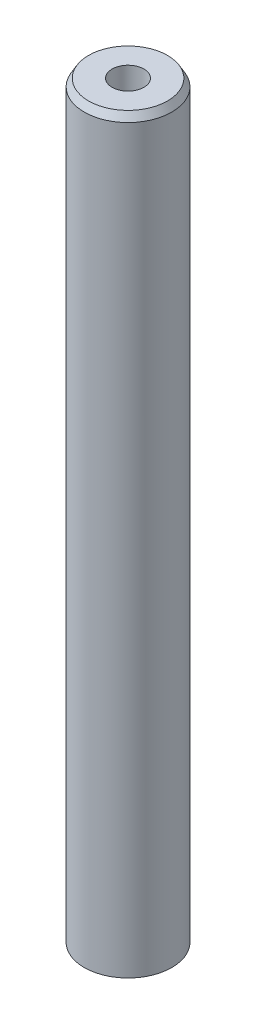
ISO-10303-21;
HEADER;
FILE_DESCRIPTION(('STEP AP214'),'2;1');
FILE_NAME('part.step','',(''),(''),'','','');
FILE_SCHEMA(('AUTOMOTIVE_DESIGN { 1 0 10303 214 1 1 1 1 }'));
ENDSEC;
DATA;
#1=APPLICATION_CONTEXT('core data for automotive mechanical design processes');
#2=APPLICATION_PROTOCOL_DEFINITION('international standard','automotive_design',2000,#1);
#3=PRODUCT_CONTEXT('',#1,'mechanical');
#4=PRODUCT('Part','Part','',(#3));
#5=PRODUCT_RELATED_PRODUCT_CATEGORY('part','',(#4));
#6=PRODUCT_DEFINITION_FORMATION('','',#4);
#7=PRODUCT_DEFINITION_CONTEXT('part definition',#1,'design');
#8=PRODUCT_DEFINITION('design','',#6,#7);
#9=PRODUCT_DEFINITION_SHAPE('','',#8);
#10=(LENGTH_UNIT() NAMED_UNIT(*) SI_UNIT(.MILLI.,.METRE.));
#11=(NAMED_UNIT(*) PLANE_ANGLE_UNIT() SI_UNIT($,.RADIAN.));
#12=(NAMED_UNIT(*) SI_UNIT($,.STERADIAN.) SOLID_ANGLE_UNIT());
#13=UNCERTAINTY_MEASURE_WITH_UNIT(LENGTH_MEASURE(1.E-05),#10,'distance_accuracy_value','');
#14=(GEOMETRIC_REPRESENTATION_CONTEXT(3) GLOBAL_UNCERTAINTY_ASSIGNED_CONTEXT((#13)) GLOBAL_UNIT_ASSIGNED_CONTEXT((#10,
#11,#12)) REPRESENTATION_CONTEXT('',''));
#15=CARTESIAN_POINT('',(0.,0.,0.));
#16=DIRECTION('',(0.,0.,1.));
#17=DIRECTION('',(1.,0.,0.));
#18=AXIS2_PLACEMENT_3D('',#15,#16,#17);
#19=CARTESIAN_POINT('',(0.,214.813731431257,0.));
#20=DIRECTION('',(0.,-1.,0.));
#21=DIRECTION('',(0.,0.,-1.));
#22=AXIS2_PLACEMENT_3D('',#19,#20,#21);
#23=CYLINDRICAL_SURFACE('',#22,12.5);
#24=CARTESIAN_POINT('',(0.,212.677016830105,0.));
#25=DIRECTION('',(0.,1.,0.));
#26=DIRECTION('',(0.,0.,1.));
#27=AXIS2_PLACEMENT_3D('',#24,#25,#26);
#28=CIRCLE('',#27,12.5);
#29=CARTESIAN_POINT('',(0.,212.677016830105,-12.5));
#30=VERTEX_POINT('',#29);
#31=EDGE_CURVE('E50',#30,#30,#28,.F.);
#32=CARTESIAN_POINT('',(0.,1.23363275015695,0.));
#33=DIRECTION('',(0.,1.,0.));
#34=DIRECTION('',(0.,0.,1.));
#35=AXIS2_PLACEMENT_3D('',#32,#33,#34);
#36=CIRCLE('',#35,12.5);
#37=CARTESIAN_POINT('',(0.,1.23363275015692,-12.5));
#38=VERTEX_POINT('',#37);
#39=EDGE_CURVE('E51',#38,#38,#36,.T.);
#40=CARTESIAN_POINT('',(0.,212.677016830105,-12.5));
#41=CARTESIAN_POINT('',(0.,210.474481579272,-12.5));
#42=CARTESIAN_POINT('',(0.,208.271946328439,-12.5));
#43=CARTESIAN_POINT('',(0.,203.866875826774,-12.5));
#44=CARTESIAN_POINT('',(0.,201.664340575941,-12.5));
#45=CARTESIAN_POINT('',(0.,197.259270074275,-12.5));
#46=CARTESIAN_POINT('',(0.,195.056734823442,-12.5));
#47=CARTESIAN_POINT('',(0.,190.651664321777,-12.5));
#48=CARTESIAN_POINT('',(0.,188.449129070944,-12.5));
#49=CARTESIAN_POINT('',(0.,184.044058569278,-12.5));
#50=CARTESIAN_POINT('',(0.,181.841523318446,-12.5));
#51=CARTESIAN_POINT('',(0.,177.43645281678,-12.5));
#52=CARTESIAN_POINT('',(0.,175.233917565947,-12.5));
#53=CARTESIAN_POINT('',(0.,170.828847064282,-12.5));
#54=CARTESIAN_POINT('',(0.,168.626311813449,-12.5));
#55=CARTESIAN_POINT('',(0.,164.221241311783,-12.5));
#56=CARTESIAN_POINT('',(0.,162.018706060951,-12.5));
#57=CARTESIAN_POINT('',(0.,157.613635559285,-12.5));
#58=CARTESIAN_POINT('',(0.,155.411100308452,-12.5));
#59=CARTESIAN_POINT('',(0.,151.006029806787,-12.5));
#60=CARTESIAN_POINT('',(0.,148.803494555954,-12.5));
#61=CARTESIAN_POINT('',(0.,144.398424054288,-12.5));
#62=CARTESIAN_POINT('',(0.,142.195888803455,-12.5));
#63=CARTESIAN_POINT('',(0.,137.79081830179,-12.5));
#64=CARTESIAN_POINT('',(0.,135.588283050957,-12.5));
#65=CARTESIAN_POINT('',(0.,131.183212549291,-12.5));
#66=CARTESIAN_POINT('',(0.,128.980677298459,-12.5));
#67=CARTESIAN_POINT('',(0.,124.575606796793,-12.5));
#68=CARTESIAN_POINT('',(0.,122.37307154596,-12.5));
#69=CARTESIAN_POINT('',(0.,117.968001044295,-12.5));
#70=CARTESIAN_POINT('',(0.,115.765465793462,-12.5));
#71=CARTESIAN_POINT('',(0.,111.360395291796,-12.5));
#72=CARTESIAN_POINT('',(0.,109.157860040964,-12.5));
#73=CARTESIAN_POINT('',(0.,104.752789539298,-12.5));
#74=CARTESIAN_POINT('',(0.,102.550254288465,-12.5));
#75=CARTESIAN_POINT('',(0.,98.1451837867996,-12.5));
#76=CARTESIAN_POINT('',(0.,95.9426485359669,-12.5));
#77=CARTESIAN_POINT('',(0.,91.5375780343013,-12.5));
#78=CARTESIAN_POINT('',(0.,89.3350427834685,-12.5));
#79=CARTESIAN_POINT('',(0.,84.9299722818029,-12.5));
#80=CARTESIAN_POINT('',(0.,82.7274370309701,-12.5));
#81=CARTESIAN_POINT('',(0.,78.3223665293045,-12.5));
#82=CARTESIAN_POINT('',(0.,76.1198312784718,-12.5));
#83=CARTESIAN_POINT('',(0.,71.7147607768062,-12.5));
#84=CARTESIAN_POINT('',(0.,69.5122255259734,-12.5));
#85=CARTESIAN_POINT('',(0.,65.1071550243078,-12.5));
#86=CARTESIAN_POINT('',(0.,62.904619773475,-12.5));
#87=CARTESIAN_POINT('',(0.,58.4995492718094,-12.5));
#88=CARTESIAN_POINT('',(0.,56.2970140209766,-12.5));
#89=CARTESIAN_POINT('',(0.,51.8919435193111,-12.5));
#90=CARTESIAN_POINT('',(0.,49.6894082684783,-12.5));
#91=CARTESIAN_POINT('',(0.,45.2843377668127,-12.5));
#92=CARTESIAN_POINT('',(0.,43.0818025159799,-12.5));
#93=CARTESIAN_POINT('',(0.,38.6767320143143,-12.5));
#94=CARTESIAN_POINT('',(0.,36.4741967634816,-12.5));
#95=CARTESIAN_POINT('',(0.,32.069126261816,-12.5));
#96=CARTESIAN_POINT('',(0.,29.8665910109832,-12.5));
#97=CARTESIAN_POINT('',(0.,25.4615205093176,-12.5));
#98=CARTESIAN_POINT('',(0.,23.2589852584848,-12.5));
#99=CARTESIAN_POINT('',(0.,18.8539147568192,-12.5));
#100=CARTESIAN_POINT('',(0.,16.6513795059865,-12.5));
#101=CARTESIAN_POINT('',(0.,12.2463090043209,-12.5));
#102=CARTESIAN_POINT('',(0.,10.0437737534881,-12.5));
#103=CARTESIAN_POINT('',(0.,5.63870325182249,-12.5));
#104=CARTESIAN_POINT('',(0.,3.43616800098971,-12.5));
#105=CARTESIAN_POINT('',(0.,1.23363275015692,-12.5));
#106=B_SPLINE_CURVE_WITH_KNOTS('',3,(#40,#41,#42,#43,#44,#45,#46,#47,#48,#49,#50,#51,#52,#53,
#54,#55,#56,#57,#58,#59,#60,#61,#62,#63,#64,#65,#66,#67,#68,#69,#70,#71,#72,#73,#74,#75,#76,#77,
#78,#79,#80,#81,#82,#83,#84,#85,#86,#87,#88,#89,#90,#91,#92,#93,#94,#95,#96,#97,#98,#99,#100,
#101,#102,#103,#104,#105),.UNSPECIFIED.,.F.,.F.,(4,2,2,2,2,2,2,2,2,2,2,2,2,2,2,2,2,2,2,2,2,2,2,
2,2,2,2,2,2,2,2,2,4),(0.,6.60760575249836,13.2152115049967,19.8228172574951,26.4304230099935,
33.0380287624918,39.6456345149902,46.2532402674886,52.8608460199869,59.4684517724853,
66.0760575249837,72.683663277482,79.2912690299804,85.8988747824788,92.5064805349771,
99.1140862874755,105.721692039974,112.329297792472,118.936903544971,125.544509297469,
132.152115049967,138.759720802466,145.367326554964,151.974932307462,158.582538059961,
165.190143812459,171.797749564958,178.405355317456,185.012961069954,191.620566822453,
198.228172574951,204.835778327449,211.443384079948),.UNSPECIFIED.);
#107=EDGE_CURVE('BSEAM39',#30,#38,#106,.T.);
#108=ORIENTED_EDGE('',*,*,#31,.T.);
#109=ORIENTED_EDGE('',*,*,#39,.T.);
#110=ORIENTED_EDGE('',*,*,#107,.T.);
#111=ORIENTED_EDGE('',*,*,#107,.F.);
#112=EDGE_LOOP('',(#108,#110,#109,#111));
#113=FACE_BOUND('',#112,.T.);
#114=ADVANCED_FACE('F39',(#113),#23,.T.);
#115=CARTESIAN_POINT('',(0.,214.813731431257,0.));
#116=DIRECTION('',(0.,1.,0.));
#117=DIRECTION('',(0.,0.,1.));
#118=AXIS2_PLACEMENT_3D('',#115,#116,#117);
#119=PLANE('',#118);
#120=CARTESIAN_POINT('',(0.,214.813731431257,0.));
#121=DIRECTION('',(0.,1.,0.));
#122=DIRECTION('',(0.,0.,1.));
#123=AXIS2_PLACEMENT_3D('',#120,#121,#122);
#124=CIRCLE('',#123,11.2663672498432);
#125=CARTESIAN_POINT('',(0.,214.813731431257,11.2663672498432));
#126=VERTEX_POINT('',#125);
#127=EDGE_CURVE('E54',#126,#126,#124,.T.);
#128=ORIENTED_EDGE('',*,*,#127,.T.);
#129=EDGE_LOOP('',(#128));
#130=FACE_BOUND('',#129,.T.);
#131=CARTESIAN_POINT('',(0.,214.813731431257,0.));
#132=DIRECTION('',(0.,1.,0.));
#133=DIRECTION('',(0.,0.,1.));
#134=AXIS2_PLACEMENT_3D('',#131,#132,#133);
#135=CIRCLE('',#134,4.53529627564343);
#136=CARTESIAN_POINT('',(0.,214.813731431257,-4.53529627564343));
#137=VERTEX_POINT('',#136);
#138=EDGE_CURVE('E58',#137,#137,#135,.T.);
#139=ORIENTED_EDGE('',*,*,#138,.F.);
#140=EDGE_LOOP('',(#139));
#141=FACE_BOUND('',#140,.T.);
#142=ADVANCED_FACE('F69',(#130,#141),#119,.T.);
#143=CARTESIAN_POINT('',(0.,0.,0.));
#144=DIRECTION('',(0.,1.,0.));
#145=DIRECTION('',(0.,0.,1.));
#146=AXIS2_PLACEMENT_3D('',#143,#144,#145);
#147=PLANE('',#146);
#148=CARTESIAN_POINT('',(0.,0.,0.));
#149=DIRECTION('',(0.,1.,0.));
#150=DIRECTION('',(0.,0.,1.));
#151=AXIS2_PLACEMENT_3D('',#148,#149,#150);
#152=CIRCLE('',#151,10.3632853988472);
#153=CARTESIAN_POINT('',(0.,0.,10.3632853988472));
#154=VERTEX_POINT('',#153);
#155=EDGE_CURVE('E10',#154,#154,#152,.F.);
#156=ORIENTED_EDGE('',*,*,#155,.T.);
#157=EDGE_LOOP('',(#156));
#158=FACE_BOUND('',#157,.T.);
#159=CARTESIAN_POINT('',(0.,0.,0.));
#160=DIRECTION('',(0.,1.,0.));
#161=DIRECTION('',(0.,0.,1.));
#162=AXIS2_PLACEMENT_3D('',#159,#160,#161);
#163=CIRCLE('',#162,4.53529627564343);
#164=CARTESIAN_POINT('',(0.,0.,-4.53529627564343));
#165=VERTEX_POINT('',#164);
#166=EDGE_CURVE('E63',#165,#165,#163,.T.);
#167=ORIENTED_EDGE('',*,*,#166,.T.);
#168=EDGE_LOOP('',(#167));
#169=FACE_BOUND('',#168,.T.);
#170=ADVANCED_FACE('F75',(#158,#169),#147,.F.);
#171=CARTESIAN_POINT('',(0.,214.813731431257,0.));
#172=DIRECTION('',(0.,-1.,0.));
#173=DIRECTION('',(0.,0.,-1.));
#174=AXIS2_PLACEMENT_3D('',#171,#172,#173);
#175=CYLINDRICAL_SURFACE('',#174,4.53529627564343);
#176=CARTESIAN_POINT('',(0.,214.813731431257,-4.53529627564343));
#177=CARTESIAN_POINT('',(0.,212.576088395515,-4.53529627564343));
#178=CARTESIAN_POINT('',(0.,210.338445359773,-4.53529627564343));
#179=CARTESIAN_POINT('',(0.,205.863159288288,-4.53529627564343));
#180=CARTESIAN_POINT('',(0.,203.625516252546,-4.53529627564343));
#181=CARTESIAN_POINT('',(0.,199.150230181061,-4.53529627564343));
#182=CARTESIAN_POINT('',(0.,196.912587145319,-4.53529627564343));
#183=CARTESIAN_POINT('',(0.,192.437301073835,-4.53529627564343));
#184=CARTESIAN_POINT('',(0.,190.199658038092,-4.53529627564343));
#185=CARTESIAN_POINT('',(0.,185.724371966608,-4.53529627564343));
#186=CARTESIAN_POINT('',(0.,183.486728930866,-4.53529627564343));
#187=CARTESIAN_POINT('',(0.,179.011442859381,-4.53529627564343));
#188=CARTESIAN_POINT('',(0.,176.773799823639,-4.53529627564343));
#189=CARTESIAN_POINT('',(0.,172.298513752154,-4.53529627564343));
#190=CARTESIAN_POINT('',(0.,170.060870716412,-4.53529627564343));
#191=CARTESIAN_POINT('',(0.,165.585584644927,-4.53529627564343));
#192=CARTESIAN_POINT('',(0.,163.347941609185,-4.53529627564343));
#193=CARTESIAN_POINT('',(0.,158.872655537701,-4.53529627564343));
#194=CARTESIAN_POINT('',(0.,156.635012501958,-4.53529627564343));
#195=CARTESIAN_POINT('',(0.,152.159726430474,-4.53529627564343));
#196=CARTESIAN_POINT('',(0.,149.922083394732,-4.53529627564343));
#197=CARTESIAN_POINT('',(0.,145.446797323247,-4.53529627564343));
#198=CARTESIAN_POINT('',(0.,143.209154287505,-4.53529627564343));
#199=CARTESIAN_POINT('',(0.,138.73386821602,-4.53529627564343));
#200=CARTESIAN_POINT('',(0.,136.496225180278,-4.53529627564343));
#201=CARTESIAN_POINT('',(0.,132.020939108793,-4.53529627564343));
#202=CARTESIAN_POINT('',(0.,129.783296073051,-4.53529627564343));
#203=CARTESIAN_POINT('',(0.,125.308010001567,-4.53529627564343));
#204=CARTESIAN_POINT('',(0.,123.070366965824,-4.53529627564343));
#205=CARTESIAN_POINT('',(0.,118.59508089434,-4.53529627564343));
#206=CARTESIAN_POINT('',(0.,116.357437858598,-4.53529627564343));
#207=CARTESIAN_POINT('',(0.,111.882151787113,-4.53529627564343));
#208=CARTESIAN_POINT('',(0.,109.644508751371,-4.53529627564343));
#209=CARTESIAN_POINT('',(0.,105.169222679886,-4.53529627564343));
#210=CARTESIAN_POINT('',(0.,102.931579644144,-4.53529627564343));
#211=CARTESIAN_POINT('',(0.,98.4562935726595,-4.53529627564343));
#212=CARTESIAN_POINT('',(0.,96.2186505369173,-4.53529627564343));
#213=CARTESIAN_POINT('',(0.,91.7433644654328,-4.53529627564343));
#214=CARTESIAN_POINT('',(0.,89.5057214296905,-4.53529627564343));
#215=CARTESIAN_POINT('',(0.,85.030435358206,-4.53529627564343));
#216=CARTESIAN_POINT('',(0.,82.7927923224637,-4.53529627564343));
#217=CARTESIAN_POINT('',(0.,78.3175062509792,-4.53529627564343));
#218=CARTESIAN_POINT('',(0.,76.079863215237,-4.53529627564343));
#219=CARTESIAN_POINT('',(0.,71.6045771437524,-4.53529627564343));
#220=CARTESIAN_POINT('',(0.,69.3669341080102,-4.53529627564343));
#221=CARTESIAN_POINT('',(0.,64.8916480365256,-4.53529627564343));
#222=CARTESIAN_POINT('',(0.,62.6540050007834,-4.53529627564343));
#223=CARTESIAN_POINT('',(0.,58.1787189292988,-4.53529627564343));
#224=CARTESIAN_POINT('',(0.,55.9410758935566,-4.53529627564343));
#225=CARTESIAN_POINT('',(0.,51.4657898220721,-4.53529627564343));
#226=CARTESIAN_POINT('',(0.,49.2281467863298,-4.53529627564343));
#227=CARTESIAN_POINT('',(0.,44.7528607148453,-4.53529627564343));
#228=CARTESIAN_POINT('',(0.,42.515217679103,-4.53529627564343));
#229=CARTESIAN_POINT('',(0.,38.0399316076185,-4.53529627564343));
#230=CARTESIAN_POINT('',(0.,35.8022885718762,-4.53529627564343));
#231=CARTESIAN_POINT('',(0.,31.3270025003917,-4.53529627564343));
#232=CARTESIAN_POINT('',(0.,29.0893594646494,-4.53529627564343));
#233=CARTESIAN_POINT('',(0.,24.6140733931649,-4.53529627564343));
#234=CARTESIAN_POINT('',(0.,22.3764303574226,-4.53529627564343));
#235=CARTESIAN_POINT('',(0.,17.9011442859381,-4.53529627564343));
#236=CARTESIAN_POINT('',(0.,15.6635012501958,-4.53529627564343));
#237=CARTESIAN_POINT('',(0.,11.1882151787113,-4.53529627564343));
#238=CARTESIAN_POINT('',(0.,8.95057214296905,-4.53529627564343));
#239=CARTESIAN_POINT('',(0.,4.47528607148453,-4.53529627564343));
#240=CARTESIAN_POINT('',(0.,2.23764303574226,-4.53529627564343));
#241=CARTESIAN_POINT('',(0.,0.,-4.53529627564343));
#242=B_SPLINE_CURVE_WITH_KNOTS('',3,(#176,#177,#178,#179,#180,#181,#182,#183,#184,#185,#186,
#187,#188,#189,#190,#191,#192,#193,#194,#195,#196,#197,#198,#199,#200,#201,#202,#203,#204,#205,
#206,#207,#208,#209,#210,#211,#212,#213,#214,#215,#216,#217,#218,#219,#220,#221,#222,#223,#224,
#225,#226,#227,#228,#229,#230,#231,#232,#233,#234,#235,#236,#237,#238,#239,#240,#241),
.UNSPECIFIED.,.F.,.F.,(4,2,2,2,2,2,2,2,2,2,2,2,2,2,2,2,2,2,2,2,2,2,2,2,2,2,2,2,2,2,2,2,4),(0.,
6.71292910722679,13.4258582144536,20.1387873216804,26.8517164289072,33.5646455361339,
40.2775746433607,46.9905037505875,53.7034328578143,60.4163619650411,67.1292910722679,
73.8422201794947,80.5551492867215,87.2680783939483,93.9810075011751,100.693936608402,
107.406865715629,114.119794822855,120.832723930082,127.545653037309,134.258582144536,
140.971511251763,147.684440358989,154.397369466216,161.110298573443,167.82322768067,
174.536156787896,181.249085895123,187.96201500235,194.674944109577,201.387873216804,
208.10080232403,214.813731431257),.UNSPECIFIED.);
#243=EDGE_CURVE('BSEAM70',#137,#165,#242,.T.);
#244=ORIENTED_EDGE('',*,*,#138,.T.);
#245=ORIENTED_EDGE('',*,*,#166,.F.);
#246=ORIENTED_EDGE('',*,*,#243,.T.);
#247=ORIENTED_EDGE('',*,*,#243,.F.);
#248=EDGE_LOOP('',(#244,#246,#245,#247));
#249=FACE_BOUND('',#248,.T.);
#250=ADVANCED_FACE('F70',(#249),#175,.F.);
#251=CARTESIAN_POINT('',(0.,214.813731431257,0.));
#252=DIRECTION('',(0.,-1.,0.));
#253=DIRECTION('',(0.,0.,-1.));
#254=AXIS2_PLACEMENT_3D('',#251,#252,#253);
#255=CONICAL_SURFACE('',#254,11.2663672498432,0.523598775598293);
#256=ORIENTED_EDGE('',*,*,#31,.F.);
#257=EDGE_LOOP('',(#256));
#258=FACE_BOUND('',#257,.T.);
#259=ORIENTED_EDGE('',*,*,#127,.F.);
#260=EDGE_LOOP('',(#259));
#261=FACE_BOUND('',#260,.T.);
#262=ADVANCED_FACE('F81',(#258,#261),#255,.T.);
#263=CARTESIAN_POINT('',(0.,1.23363275015695,0.));
#264=DIRECTION('',(0.,1.,0.));
#265=DIRECTION('',(0.,0.,1.));
#266=AXIS2_PLACEMENT_3D('',#263,#264,#265);
#267=CONICAL_SURFACE('',#266,12.5,1.04719755119661);
#268=ORIENTED_EDGE('',*,*,#155,.F.);
#269=EDGE_LOOP('',(#268));
#270=FACE_BOUND('',#269,.T.);
#271=ORIENTED_EDGE('',*,*,#39,.F.);
#272=EDGE_LOOP('',(#271));
#273=FACE_BOUND('',#272,.T.);
#274=ADVANCED_FACE('F45',(#270,#273),#267,.T.);
#275=CLOSED_SHELL('',(#114,#142,#170,#250,#262,#274));
#276=MANIFOLD_SOLID_BREP('B2',#275);
#277=ADVANCED_BREP_SHAPE_REPRESENTATION('',(#18,#276),#14);
#278=SHAPE_DEFINITION_REPRESENTATION(#9,#277);
ENDSEC;
END-ISO-10303-21;
